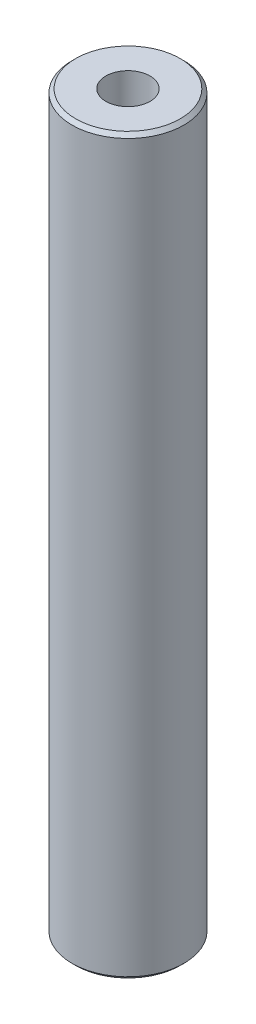
ISO-10303-21;
HEADER;
FILE_DESCRIPTION(('STEP AP214'),'2;1');
FILE_NAME('part.step','',(''),(''),'','','');
FILE_SCHEMA(('AUTOMOTIVE_DESIGN { 1 0 10303 214 1 1 1 1 }'));
ENDSEC;
DATA;
#1=APPLICATION_CONTEXT('core data for automotive mechanical design processes');
#2=APPLICATION_PROTOCOL_DEFINITION('international standard','automotive_design',2000,#1);
#3=PRODUCT_CONTEXT('',#1,'mechanical');
#4=PRODUCT('Part','Part','',(#3));
#5=PRODUCT_RELATED_PRODUCT_CATEGORY('part','',(#4));
#6=PRODUCT_DEFINITION_FORMATION('','',#4);
#7=PRODUCT_DEFINITION_CONTEXT('part definition',#1,'design');
#8=PRODUCT_DEFINITION('design','',#6,#7);
#9=PRODUCT_DEFINITION_SHAPE('','',#8);
#10=(LENGTH_UNIT() NAMED_UNIT(*) SI_UNIT(.MILLI.,.METRE.));
#11=(NAMED_UNIT(*) PLANE_ANGLE_UNIT() SI_UNIT($,.RADIAN.));
#12=(NAMED_UNIT(*) SI_UNIT($,.STERADIAN.) SOLID_ANGLE_UNIT());
#13=UNCERTAINTY_MEASURE_WITH_UNIT(LENGTH_MEASURE(1.E-05),#10,'distance_accuracy_value','');
#14=(GEOMETRIC_REPRESENTATION_CONTEXT(3) GLOBAL_UNCERTAINTY_ASSIGNED_CONTEXT((#13)) GLOBAL_UNIT_ASSIGNED_CONTEXT((#10,
#11,#12)) REPRESENTATION_CONTEXT('',''));
#15=CARTESIAN_POINT('',(0.,0.,0.));
#16=DIRECTION('',(0.,0.,1.));
#17=DIRECTION('',(1.,0.,0.));
#18=AXIS2_PLACEMENT_3D('',#15,#16,#17);
#19=CARTESIAN_POINT('',(0.,196.776789764426,0.));
#20=DIRECTION('',(0.,-1.,0.));
#21=DIRECTION('',(0.,0.,-1.));
#22=AXIS2_PLACEMENT_3D('',#19,#20,#21);
#23=CYLINDRICAL_SURFACE('',#22,15.);
#24=CARTESIAN_POINT('',(0.,195.801708168682,0.));
#25=DIRECTION('',(0.,1.,0.));
#26=DIRECTION('',(0.,0.,1.));
#27=AXIS2_PLACEMENT_3D('',#24,#25,#26);
#28=CIRCLE('',#27,15.);
#29=CARTESIAN_POINT('',(0.,195.801708168682,15.));
#30=VERTEX_POINT('',#29);
#31=EDGE_CURVE('E50',#30,#30,#28,.F.);
#32=ORIENTED_EDGE('',*,*,#31,.T.);
#33=EDGE_LOOP('',(#32));
#34=FACE_BOUND('',#33,.T.);
#35=CARTESIAN_POINT('',(0.,0.975081595744276,0.));
#36=DIRECTION('',(0.,1.,0.));
#37=DIRECTION('',(0.,0.,1.));
#38=AXIS2_PLACEMENT_3D('',#35,#36,#37);
#39=CIRCLE('',#38,15.);
#40=CARTESIAN_POINT('',(0.,0.975081595744276,15.));
#41=VERTEX_POINT('',#40);
#42=EDGE_CURVE('E51',#41,#41,#39,.T.);
#43=ORIENTED_EDGE('',*,*,#42,.T.);
#44=EDGE_LOOP('',(#43));
#45=FACE_BOUND('',#44,.T.);
#46=ADVANCED_FACE('F39',(#34,#45),#23,.T.);
#47=CARTESIAN_POINT('',(0.,196.776789764426,0.));
#48=DIRECTION('',(0.,1.,0.));
#49=DIRECTION('',(0.,0.,1.));
#50=AXIS2_PLACEMENT_3D('',#47,#48,#49);
#51=PLANE('',#50);
#52=CARTESIAN_POINT('',(0.,196.776789764426,0.));
#53=DIRECTION('',(0.,1.,0.));
#54=DIRECTION('',(0.,0.,1.));
#55=AXIS2_PLACEMENT_3D('',#52,#53,#54);
#56=CIRCLE('',#55,14.0249184042557);
#57=CARTESIAN_POINT('',(0.,196.776789764426,14.0249184042557));
#58=VERTEX_POINT('',#57);
#59=EDGE_CURVE('E54',#58,#58,#56,.T.);
#60=ORIENTED_EDGE('',*,*,#59,.T.);
#61=EDGE_LOOP('',(#60));
#62=FACE_BOUND('',#61,.T.);
#63=CARTESIAN_POINT('',(0.,196.776789764426,0.));
#64=DIRECTION('',(0.,1.,0.));
#65=DIRECTION('',(0.,0.,1.));
#66=AXIS2_PLACEMENT_3D('',#63,#64,#65);
#67=CIRCLE('',#66,5.92507094950821);
#68=CARTESIAN_POINT('',(0.,196.776789764426,5.92507094950821));
#69=VERTEX_POINT('',#68);
#70=EDGE_CURVE('E58',#69,#69,#67,.T.);
#71=ORIENTED_EDGE('',*,*,#70,.F.);
#72=EDGE_LOOP('',(#71));
#73=FACE_BOUND('',#72,.T.);
#74=ADVANCED_FACE('F69',(#62,#73),#51,.T.);
#75=CARTESIAN_POINT('',(0.,0.,0.));
#76=DIRECTION('',(0.,1.,0.));
#77=DIRECTION('',(0.,0.,1.));
#78=AXIS2_PLACEMENT_3D('',#75,#76,#77);
#79=PLANE('',#78);
#80=CARTESIAN_POINT('',(0.,0.,0.));
#81=DIRECTION('',(0.,1.,0.));
#82=DIRECTION('',(0.,0.,1.));
#83=AXIS2_PLACEMENT_3D('',#80,#81,#82);
#84=CIRCLE('',#83,14.0249184042557);
#85=CARTESIAN_POINT('',(0.,0.,14.0249184042557));
#86=VERTEX_POINT('',#85);
#87=EDGE_CURVE('E10',#86,#86,#84,.F.);
#88=ORIENTED_EDGE('',*,*,#87,.T.);
#89=EDGE_LOOP('',(#88));
#90=FACE_BOUND('',#89,.T.);
#91=CARTESIAN_POINT('',(0.,0.,0.));
#92=DIRECTION('',(0.,1.,0.));
#93=DIRECTION('',(0.,0.,1.));
#94=AXIS2_PLACEMENT_3D('',#91,#92,#93);
#95=CIRCLE('',#94,5.92507094950821);
#96=CARTESIAN_POINT('',(0.,0.,5.92507094950821));
#97=VERTEX_POINT('',#96);
#98=EDGE_CURVE('E63',#97,#97,#95,.T.);
#99=ORIENTED_EDGE('',*,*,#98,.T.);
#100=EDGE_LOOP('',(#99));
#101=FACE_BOUND('',#100,.T.);
#102=ADVANCED_FACE('F75',(#90,#101),#79,.F.);
#103=CARTESIAN_POINT('',(0.,196.776789764426,0.));
#104=DIRECTION('',(0.,-1.,0.));
#105=DIRECTION('',(0.,0.,-1.));
#106=AXIS2_PLACEMENT_3D('',#103,#104,#105);
#107=CYLINDRICAL_SURFACE('',#106,5.92507094950821);
#108=ORIENTED_EDGE('',*,*,#70,.T.);
#109=EDGE_LOOP('',(#108));
#110=FACE_BOUND('',#109,.T.);
#111=ORIENTED_EDGE('',*,*,#98,.F.);
#112=EDGE_LOOP('',(#111));
#113=FACE_BOUND('',#112,.T.);
#114=ADVANCED_FACE('F70',(#110,#113),#107,.F.);
#115=CARTESIAN_POINT('',(0.,196.776789764426,0.));
#116=DIRECTION('',(0.,-1.,0.));
#117=DIRECTION('',(0.,0.,-1.));
#118=AXIS2_PLACEMENT_3D('',#115,#116,#117);
#119=CONICAL_SURFACE('',#118,14.0249184042557,0.785398163397455);
#120=ORIENTED_EDGE('',*,*,#31,.F.);
#121=EDGE_LOOP('',(#120));
#122=FACE_BOUND('',#121,.T.);
#123=ORIENTED_EDGE('',*,*,#59,.F.);
#124=EDGE_LOOP('',(#123));
#125=FACE_BOUND('',#124,.T.);
#126=ADVANCED_FACE('F81',(#122,#125),#119,.T.);
#127=CARTESIAN_POINT('',(0.,0.975081595744276,0.));
#128=DIRECTION('',(0.,1.,0.));
#129=DIRECTION('',(0.,0.,1.));
#130=AXIS2_PLACEMENT_3D('',#127,#128,#129);
#131=CONICAL_SURFACE('',#130,15.,0.785398163397455);
#132=ORIENTED_EDGE('',*,*,#87,.F.);
#133=EDGE_LOOP('',(#132));
#134=FACE_BOUND('',#133,.T.);
#135=ORIENTED_EDGE('',*,*,#42,.F.);
#136=EDGE_LOOP('',(#135));
#137=FACE_BOUND('',#136,.T.);
#138=ADVANCED_FACE('F45',(#134,#137),#131,.T.);
#139=CLOSED_SHELL('',(#46,#74,#102,#114,#126,#138));
#140=MANIFOLD_SOLID_BREP('B2',#139);
#141=ADVANCED_BREP_SHAPE_REPRESENTATION('',(#18,#140),#14);
#142=SHAPE_DEFINITION_REPRESENTATION(#9,#141);
ENDSEC;
END-ISO-10303-21;
